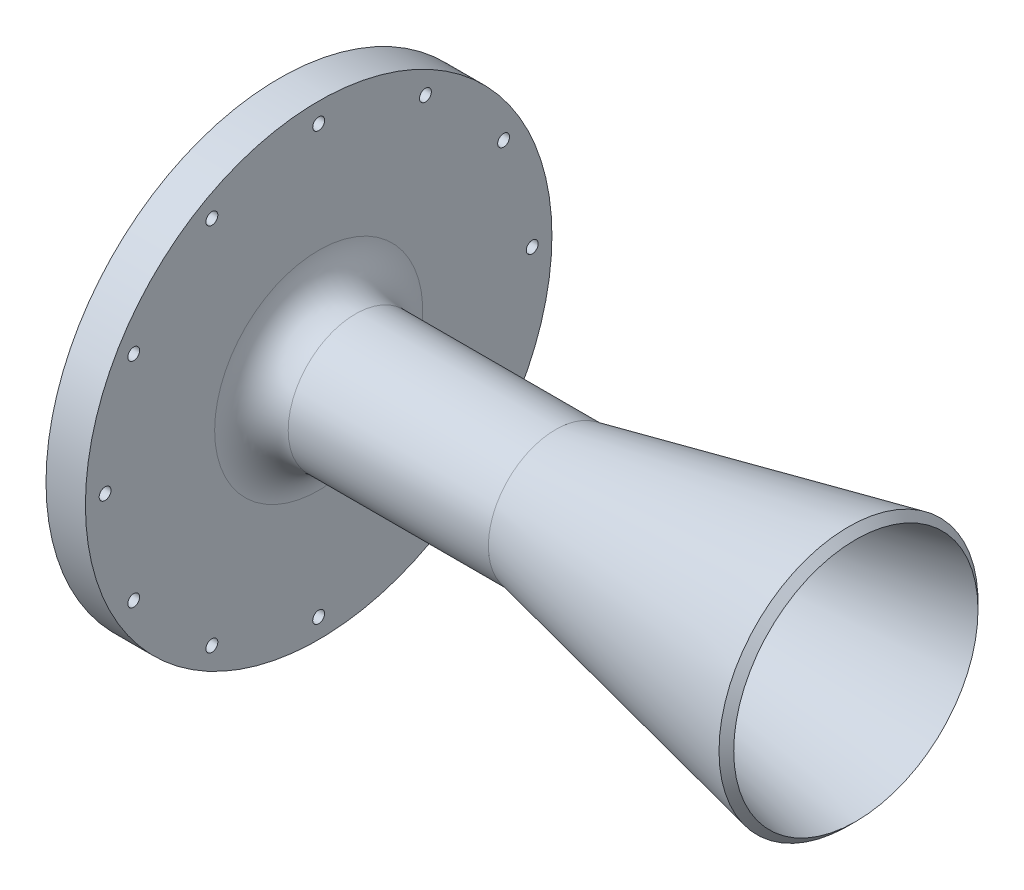
ISO-10303-21;
HEADER;
FILE_DESCRIPTION(('STEP AP214'),'2;1');
FILE_NAME('part.step','',(''),(''),'','','');
FILE_SCHEMA(('AUTOMOTIVE_DESIGN { 1 0 10303 214 1 1 1 1 }'));
ENDSEC;
DATA;
#1=APPLICATION_CONTEXT('core data for automotive mechanical design processes');
#2=APPLICATION_PROTOCOL_DEFINITION('international standard','automotive_design',2000,#1);
#3=PRODUCT_CONTEXT('',#1,'mechanical');
#4=PRODUCT('Part','Part','',(#3));
#5=PRODUCT_RELATED_PRODUCT_CATEGORY('part','',(#4));
#6=PRODUCT_DEFINITION_FORMATION('','',#4);
#7=PRODUCT_DEFINITION_CONTEXT('part definition',#1,'design');
#8=PRODUCT_DEFINITION('design','',#6,#7);
#9=PRODUCT_DEFINITION_SHAPE('','',#8);
#10=(LENGTH_UNIT() NAMED_UNIT(*) SI_UNIT(.MILLI.,.METRE.));
#11=(NAMED_UNIT(*) PLANE_ANGLE_UNIT() SI_UNIT($,.RADIAN.));
#12=(NAMED_UNIT(*) SI_UNIT($,.STERADIAN.) SOLID_ANGLE_UNIT());
#13=UNCERTAINTY_MEASURE_WITH_UNIT(LENGTH_MEASURE(1.E-05),#10,'distance_accuracy_value','');
#14=(GEOMETRIC_REPRESENTATION_CONTEXT(3) GLOBAL_UNCERTAINTY_ASSIGNED_CONTEXT((#13)) GLOBAL_UNIT_ASSIGNED_CONTEXT((#10,
#11,#12)) REPRESENTATION_CONTEXT('',''));
#15=CARTESIAN_POINT('',(0.,0.,0.));
#16=DIRECTION('',(0.,0.,1.));
#17=DIRECTION('',(1.,0.,0.));
#18=AXIS2_PLACEMENT_3D('',#15,#16,#17);
#19=CARTESIAN_POINT('',(0.,20.583496155902,0.));
#20=DIRECTION('',(1.,0.,0.));
#21=DIRECTION('',(0.,0.,-1.));
#22=AXIS2_PLACEMENT_3D('',#19,#20,#21);
#23=PLANE('',#22);
#24=CARTESIAN_POINT('',(0.,0.,0.));
#25=DIRECTION('',(1.,0.,0.));
#26=DIRECTION('',(0.,0.,-1.));
#27=AXIS2_PLACEMENT_3D('',#24,#25,#26);
#28=CIRCLE('',#27,38.1);
#29=CARTESIAN_POINT('',(0.,0.,-38.1));
#30=VERTEX_POINT('',#29);
#31=EDGE_CURVE('E170',#30,#30,#28,.T.);
#32=ORIENTED_EDGE('',*,*,#31,.T.);
#33=EDGE_LOOP('',(#32));
#34=FACE_BOUND('',#33,.T.);
#35=CARTESIAN_POINT('',(0.,-13.3616626129386,49.8664037450867));
#36=DIRECTION('',(-1.,0.,0.));
#37=DIRECTION('',(0.,0.,1.));
#38=AXIS2_PLACEMENT_3D('',#35,#36,#37);
#39=CIRCLE('',#38,2.38125);
#40=CARTESIAN_POINT('',(0.,-13.3616626129386,52.2476537450867));
#41=VERTEX_POINT('',#40);
#42=EDGE_CURVE('E61',#41,#41,#39,.T.);
#43=ORIENTED_EDGE('',*,*,#42,.F.);
#44=EDGE_LOOP('',(#43));
#45=FACE_BOUND('',#44,.T.);
#46=CARTESIAN_POINT('',(0.,13.3616626129382,-49.8664037450868));
#47=DIRECTION('',(-1.,0.,0.));
#48=DIRECTION('',(0.,0.,1.));
#49=AXIS2_PLACEMENT_3D('',#46,#47,#48);
#50=CIRCLE('',#49,2.38125);
#51=CARTESIAN_POINT('',(0.,13.3616626129382,-47.4851537450868));
#52=VERTEX_POINT('',#51);
#53=EDGE_CURVE('E60',#52,#52,#50,.T.);
#54=ORIENTED_EDGE('',*,*,#53,.F.);
#55=EDGE_LOOP('',(#54));
#56=FACE_BOUND('',#55,.T.);
#57=CARTESIAN_POINT('',(0.,-44.7089944830735,-25.81275));
#58=DIRECTION('',(-1.,0.,0.));
#59=DIRECTION('',(0.,0.,1.));
#60=AXIS2_PLACEMENT_3D('',#57,#58,#59);
#61=CIRCLE('',#60,1.43509999999999);
#62=CARTESIAN_POINT('',(0.,-44.7089944830735,-24.37765));
#63=VERTEX_POINT('',#62);
#64=EDGE_CURVE('E79',#63,#63,#61,.T.);
#65=ORIENTED_EDGE('',*,*,#64,.F.);
#66=EDGE_LOOP('',(#65));
#67=FACE_BOUND('',#66,.T.);
#68=CARTESIAN_POINT('',(0.,-25.81275,-44.7089944830735));
#69=DIRECTION('',(-1.,0.,0.));
#70=DIRECTION('',(0.,0.,1.));
#71=AXIS2_PLACEMENT_3D('',#68,#69,#70);
#72=CIRCLE('',#71,1.43509999999999);
#73=CARTESIAN_POINT('',(0.,-25.81275,-43.2738944830735));
#74=VERTEX_POINT('',#73);
#75=EDGE_CURVE('E85',#74,#74,#72,.T.);
#76=ORIENTED_EDGE('',*,*,#75,.F.);
#77=EDGE_LOOP('',(#76));
#78=FACE_BOUND('',#77,.T.);
#79=CARTESIAN_POINT('',(0.,0.,-51.6255));
#80=DIRECTION('',(-1.,0.,0.));
#81=DIRECTION('',(0.,0.,1.));
#82=AXIS2_PLACEMENT_3D('',#79,#80,#81);
#83=CIRCLE('',#82,1.43509999999999);
#84=CARTESIAN_POINT('',(0.,0.,-50.1904));
#85=VERTEX_POINT('',#84);
#86=EDGE_CURVE('E91',#85,#85,#83,.T.);
#87=ORIENTED_EDGE('',*,*,#86,.F.);
#88=EDGE_LOOP('',(#87));
#89=FACE_BOUND('',#88,.T.);
#90=CARTESIAN_POINT('',(0.,25.81275,-44.7089944830735));
#91=DIRECTION('',(-1.,0.,0.));
#92=DIRECTION('',(0.,0.,1.));
#93=AXIS2_PLACEMENT_3D('',#90,#91,#92);
#94=CIRCLE('',#93,1.43509999999999);
#95=CARTESIAN_POINT('',(0.,25.81275,-43.2738944830736));
#96=VERTEX_POINT('',#95);
#97=EDGE_CURVE('E97',#96,#96,#94,.T.);
#98=ORIENTED_EDGE('',*,*,#97,.F.);
#99=EDGE_LOOP('',(#98));
#100=FACE_BOUND('',#99,.T.);
#101=CARTESIAN_POINT('',(0.,44.7089944830735,-25.81275));
#102=DIRECTION('',(-1.,0.,0.));
#103=DIRECTION('',(0.,0.,1.));
#104=AXIS2_PLACEMENT_3D('',#101,#102,#103);
#105=CIRCLE('',#104,1.43509999999999);
#106=CARTESIAN_POINT('',(0.,44.7089944830735,-24.37765));
#107=VERTEX_POINT('',#106);
#108=EDGE_CURVE('E103',#107,#107,#105,.T.);
#109=ORIENTED_EDGE('',*,*,#108,.F.);
#110=EDGE_LOOP('',(#109));
#111=FACE_BOUND('',#110,.T.);
#112=CARTESIAN_POINT('',(0.,51.6255,0.));
#113=DIRECTION('',(-1.,0.,0.));
#114=DIRECTION('',(0.,0.,1.));
#115=AXIS2_PLACEMENT_3D('',#112,#113,#114);
#116=CIRCLE('',#115,1.43509999999999);
#117=CARTESIAN_POINT('',(0.,51.6255,1.43509999999999));
#118=VERTEX_POINT('',#117);
#119=EDGE_CURVE('E109',#118,#118,#116,.T.);
#120=ORIENTED_EDGE('',*,*,#119,.F.);
#121=EDGE_LOOP('',(#120));
#122=FACE_BOUND('',#121,.T.);
#123=CARTESIAN_POINT('',(0.,44.7089944830736,25.81275));
#124=DIRECTION('',(-1.,0.,0.));
#125=DIRECTION('',(0.,0.,1.));
#126=AXIS2_PLACEMENT_3D('',#123,#124,#125);
#127=CIRCLE('',#126,1.43509999999999);
#128=CARTESIAN_POINT('',(0.,44.7089944830736,27.24785));
#129=VERTEX_POINT('',#128);
#130=EDGE_CURVE('E115',#129,#129,#127,.T.);
#131=ORIENTED_EDGE('',*,*,#130,.F.);
#132=EDGE_LOOP('',(#131));
#133=FACE_BOUND('',#132,.T.);
#134=CARTESIAN_POINT('',(0.,25.81275,44.7089944830735));
#135=DIRECTION('',(-1.,0.,0.));
#136=DIRECTION('',(0.,0.,1.));
#137=AXIS2_PLACEMENT_3D('',#134,#135,#136);
#138=CIRCLE('',#137,1.43509999999999);
#139=CARTESIAN_POINT('',(0.,25.81275,46.1440944830735));
#140=VERTEX_POINT('',#139);
#141=EDGE_CURVE('E121',#140,#140,#138,.T.);
#142=ORIENTED_EDGE('',*,*,#141,.F.);
#143=EDGE_LOOP('',(#142));
#144=FACE_BOUND('',#143,.T.);
#145=CARTESIAN_POINT('',(0.,0.,51.6255));
#146=DIRECTION('',(-1.,0.,0.));
#147=DIRECTION('',(0.,0.,1.));
#148=AXIS2_PLACEMENT_3D('',#145,#146,#147);
#149=CIRCLE('',#148,1.43509999999999);
#150=CARTESIAN_POINT('',(0.,0.,53.0606));
#151=VERTEX_POINT('',#150);
#152=EDGE_CURVE('E127',#151,#151,#149,.T.);
#153=ORIENTED_EDGE('',*,*,#152,.F.);
#154=EDGE_LOOP('',(#153));
#155=FACE_BOUND('',#154,.T.);
#156=CARTESIAN_POINT('',(0.,-25.81275,44.7089944830736));
#157=DIRECTION('',(-1.,0.,0.));
#158=DIRECTION('',(0.,0.,1.));
#159=AXIS2_PLACEMENT_3D('',#156,#157,#158);
#160=CIRCLE('',#159,1.43509999999999);
#161=CARTESIAN_POINT('',(0.,-25.81275,46.1440944830736));
#162=VERTEX_POINT('',#161);
#163=EDGE_CURVE('E133',#162,#162,#160,.T.);
#164=ORIENTED_EDGE('',*,*,#163,.F.);
#165=EDGE_LOOP('',(#164));
#166=FACE_BOUND('',#165,.T.);
#167=CARTESIAN_POINT('',(0.,-44.7089944830735,25.81275));
#168=DIRECTION('',(-1.,0.,0.));
#169=DIRECTION('',(0.,0.,1.));
#170=AXIS2_PLACEMENT_3D('',#167,#168,#169);
#171=CIRCLE('',#170,1.43509999999999);
#172=CARTESIAN_POINT('',(0.,-44.7089944830735,27.24785));
#173=VERTEX_POINT('',#172);
#174=EDGE_CURVE('E139',#173,#173,#171,.T.);
#175=ORIENTED_EDGE('',*,*,#174,.F.);
#176=EDGE_LOOP('',(#175));
#177=FACE_BOUND('',#176,.T.);
#178=CARTESIAN_POINT('',(0.,0.,0.));
#179=DIRECTION('',(-1.,0.,0.));
#180=DIRECTION('',(0.,0.,1.));
#181=AXIS2_PLACEMENT_3D('',#178,#179,#180);
#182=CIRCLE('',#181,56.388);
#183=CARTESIAN_POINT('',(0.,0.,56.388));
#184=VERTEX_POINT('',#183);
#185=EDGE_CURVE('E151',#184,#184,#182,.T.);
#186=ORIENTED_EDGE('',*,*,#185,.T.);
#187=EDGE_LOOP('',(#186));
#188=FACE_BOUND('',#187,.T.);
#189=CARTESIAN_POINT('',(0.,-51.6255,0.));
#190=DIRECTION('',(-1.,0.,0.));
#191=DIRECTION('',(0.,0.,1.));
#192=AXIS2_PLACEMENT_3D('',#189,#190,#191);
#193=CIRCLE('',#192,1.43509999999999);
#194=CARTESIAN_POINT('',(0.,-51.6255,1.43509999999999));
#195=VERTEX_POINT('',#194);
#196=EDGE_CURVE('E73',#195,#195,#193,.T.);
#197=ORIENTED_EDGE('',*,*,#196,.F.);
#198=EDGE_LOOP('',(#197));
#199=FACE_BOUND('',#198,.T.);
#200=ADVANCED_FACE('F36',(#34,#45,#56,#67,#78,#89,#100,#111,#122,#133,#144,#155,#166,#177,#188,
#199),#23,.F.);
#201=CARTESIAN_POINT('',(60.325,0.,0.));
#202=DIRECTION('',(1.,0.,0.));
#203=DIRECTION('',(0.,0.,-1.));
#204=AXIS2_PLACEMENT_3D('',#201,#202,#203);
#205=CONICAL_SURFACE('',#204,12.7207818181818,0.20943951023932);
#206=CARTESIAN_POINT('',(139.384584692517,0.,0.));
#207=DIRECTION('',(1.,0.,0.));
#208=DIRECTION('',(0.,0.,-1.));
#209=AXIS2_PLACEMENT_3D('',#206,#207,#208);
#210=CIRCLE('',#209,29.5254153074831);
#211=CARTESIAN_POINT('',(139.384584692517,0.,-29.5254153074831));
#212=VERTEX_POINT('',#211);
#213=EDGE_CURVE('E11',#212,#212,#210,.T.);
#214=ORIENTED_EDGE('',*,*,#213,.T.);
#215=EDGE_LOOP('',(#214));
#216=FACE_BOUND('',#215,.T.);
#217=CARTESIAN_POINT('',(60.325,0.,0.));
#218=DIRECTION('',(-1.,0.,0.));
#219=DIRECTION('',(0.,0.,1.));
#220=AXIS2_PLACEMENT_3D('',#217,#218,#219);
#221=CIRCLE('',#220,12.7207818181818);
#222=CARTESIAN_POINT('',(60.325,0.,12.7207818181818));
#223=VERTEX_POINT('',#222);
#224=EDGE_CURVE('E160',#223,#223,#221,.T.);
#225=ORIENTED_EDGE('',*,*,#224,.T.);
#226=EDGE_LOOP('',(#225));
#227=FACE_BOUND('',#226,.T.);
#228=ADVANCED_FACE('F188',(#216,#227),#205,.F.);
#229=CARTESIAN_POINT('',(60.325,12.7207818181818,0.));
#230=DIRECTION('',(1.,0.,0.));
#231=DIRECTION('',(0.,0.,-1.));
#232=AXIS2_PLACEMENT_3D('',#229,#230,#231);
#233=PLANE('',#232);
#234=ORIENTED_EDGE('',*,*,#224,.F.);
#235=EDGE_LOOP('',(#234));
#236=FACE_BOUND('',#235,.T.);
#237=CARTESIAN_POINT('',(60.325,0.,0.));
#238=DIRECTION('',(-1.,0.,0.));
#239=DIRECTION('',(0.,0.,1.));
#240=AXIS2_PLACEMENT_3D('',#237,#238,#239);
#241=CIRCLE('',#240,14.351);
#242=CARTESIAN_POINT('',(60.325,0.,14.351));
#243=VERTEX_POINT('',#242);
#244=EDGE_CURVE('E157',#243,#243,#241,.T.);
#245=ORIENTED_EDGE('',*,*,#244,.T.);
#246=EDGE_LOOP('',(#245));
#247=FACE_BOUND('',#246,.T.);
#248=ADVANCED_FACE('F194',(#236,#247),#233,.F.);
#249=CARTESIAN_POINT('',(0.,0.,0.));
#250=DIRECTION('',(-1.,0.,0.));
#251=DIRECTION('',(0.,0.,1.));
#252=AXIS2_PLACEMENT_3D('',#249,#250,#251);
#253=CYLINDRICAL_SURFACE('',#252,14.351);
#254=ORIENTED_EDGE('',*,*,#244,.F.);
#255=EDGE_LOOP('',(#254));
#256=FACE_BOUND('',#255,.T.);
#257=CARTESIAN_POINT('',(10.795,0.,0.));
#258=DIRECTION('',(-1.,0.,0.));
#259=DIRECTION('',(0.,0.,1.));
#260=AXIS2_PLACEMENT_3D('',#257,#258,#259);
#261=CIRCLE('',#260,14.351);
#262=CARTESIAN_POINT('',(10.795,0.,14.351));
#263=VERTEX_POINT('',#262);
#264=EDGE_CURVE('E154',#263,#263,#261,.T.);
#265=ORIENTED_EDGE('',*,*,#264,.T.);
#266=EDGE_LOOP('',(#265));
#267=FACE_BOUND('',#266,.T.);
#268=ADVANCED_FACE('F206',(#256,#267),#253,.F.);
#269=CARTESIAN_POINT('',(0.,0.,0.));
#270=DIRECTION('',(-1.,0.,0.));
#271=DIRECTION('',(0.,0.,1.));
#272=AXIS2_PLACEMENT_3D('',#269,#270,#271);
#273=CONICAL_SURFACE('',#272,20.583496155902,0.5235987755983);
#274=CARTESIAN_POINT('',(1.61402236879913,0.,0.));
#275=DIRECTION('',(-1.,0.,0.));
#276=DIRECTION('',(0.,0.,1.));
#277=AXIS2_PLACEMENT_3D('',#274,#275,#276);
#278=CIRCLE('',#277,19.6516399067978);
#279=CARTESIAN_POINT('',(1.61402236879913,0.,19.6516399067978));
#280=VERTEX_POINT('',#279);
#281=EDGE_CURVE('E67',#280,#280,#278,.T.);
#282=ORIENTED_EDGE('',*,*,#281,.T.);
#283=EDGE_LOOP('',(#282));
#284=FACE_BOUND('',#283,.T.);
#285=ORIENTED_EDGE('',*,*,#264,.F.);
#286=EDGE_LOOP('',(#285));
#287=FACE_BOUND('',#286,.T.);
#288=ADVANCED_FACE('F203',(#284,#287),#273,.F.);
#289=CARTESIAN_POINT('',(0.,0.,0.));
#290=DIRECTION('',(-1.,0.,0.));
#291=DIRECTION('',(0.,0.,1.));
#292=AXIS2_PLACEMENT_3D('',#289,#290,#291);
#293=CYLINDRICAL_SURFACE('',#292,56.388);
#294=ORIENTED_EDGE('',*,*,#185,.F.);
#295=EDGE_LOOP('',(#294));
#296=FACE_BOUND('',#295,.T.);
#297=CARTESIAN_POINT('',(9.525,0.,0.));
#298=DIRECTION('',(-1.,0.,0.));
#299=DIRECTION('',(0.,0.,1.));
#300=AXIS2_PLACEMENT_3D('',#297,#298,#299);
#301=CIRCLE('',#300,56.388);
#302=CARTESIAN_POINT('',(9.525,0.,56.388));
#303=VERTEX_POINT('',#302);
#304=EDGE_CURVE('E148',#303,#303,#301,.T.);
#305=ORIENTED_EDGE('',*,*,#304,.T.);
#306=EDGE_LOOP('',(#305));
#307=FACE_BOUND('',#306,.T.);
#308=ADVANCED_FACE('F201',(#296,#307),#293,.T.);
#309=CARTESIAN_POINT('',(9.525,56.388,0.));
#310=DIRECTION('',(-1.,0.,0.));
#311=DIRECTION('',(0.,0.,1.));
#312=AXIS2_PLACEMENT_3D('',#309,#310,#311);
#313=PLANE('',#312);
#314=CARTESIAN_POINT('',(9.525,0.,0.));
#315=DIRECTION('',(-1.,0.,0.));
#316=DIRECTION('',(0.,0.,1.));
#317=AXIS2_PLACEMENT_3D('',#314,#315,#316);
#318=CIRCLE('',#317,25.146);
#319=CARTESIAN_POINT('',(9.525,0.,25.146));
#320=VERTEX_POINT('',#319);
#321=EDGE_CURVE('E163',#320,#320,#318,.T.);
#322=ORIENTED_EDGE('',*,*,#321,.T.);
#323=EDGE_LOOP('',(#322));
#324=FACE_BOUND('',#323,.T.);
#325=CARTESIAN_POINT('',(9.525,-51.6255,0.));
#326=DIRECTION('',(-1.,0.,0.));
#327=DIRECTION('',(0.,0.,1.));
#328=AXIS2_PLACEMENT_3D('',#325,#326,#327);
#329=CIRCLE('',#328,1.43509999999999);
#330=CARTESIAN_POINT('',(9.525,-51.6255,1.43509999999999));
#331=VERTEX_POINT('',#330);
#332=EDGE_CURVE('E76',#331,#331,#329,.T.);
#333=ORIENTED_EDGE('',*,*,#332,.T.);
#334=EDGE_LOOP('',(#333));
#335=FACE_BOUND('',#334,.T.);
#336=CARTESIAN_POINT('',(9.525,-44.7089944830735,-25.81275));
#337=DIRECTION('',(-1.,0.,0.));
#338=DIRECTION('',(0.,0.,1.));
#339=AXIS2_PLACEMENT_3D('',#336,#337,#338);
#340=CIRCLE('',#339,1.43509999999999);
#341=CARTESIAN_POINT('',(9.525,-44.7089944830735,-24.37765));
#342=VERTEX_POINT('',#341);
#343=EDGE_CURVE('E82',#342,#342,#340,.T.);
#344=ORIENTED_EDGE('',*,*,#343,.T.);
#345=EDGE_LOOP('',(#344));
#346=FACE_BOUND('',#345,.T.);
#347=CARTESIAN_POINT('',(9.525,-25.81275,-44.7089944830735));
#348=DIRECTION('',(-1.,0.,0.));
#349=DIRECTION('',(0.,0.,1.));
#350=AXIS2_PLACEMENT_3D('',#347,#348,#349);
#351=CIRCLE('',#350,1.43509999999999);
#352=CARTESIAN_POINT('',(9.525,-25.81275,-43.2738944830735));
#353=VERTEX_POINT('',#352);
#354=EDGE_CURVE('E88',#353,#353,#351,.T.);
#355=ORIENTED_EDGE('',*,*,#354,.T.);
#356=EDGE_LOOP('',(#355));
#357=FACE_BOUND('',#356,.T.);
#358=CARTESIAN_POINT('',(9.525,0.,-51.6255));
#359=DIRECTION('',(-1.,0.,0.));
#360=DIRECTION('',(0.,0.,1.));
#361=AXIS2_PLACEMENT_3D('',#358,#359,#360);
#362=CIRCLE('',#361,1.43509999999999);
#363=CARTESIAN_POINT('',(9.525,0.,-50.1904));
#364=VERTEX_POINT('',#363);
#365=EDGE_CURVE('E94',#364,#364,#362,.T.);
#366=ORIENTED_EDGE('',*,*,#365,.T.);
#367=EDGE_LOOP('',(#366));
#368=FACE_BOUND('',#367,.T.);
#369=CARTESIAN_POINT('',(9.525,25.81275,-44.7089944830735));
#370=DIRECTION('',(-1.,0.,0.));
#371=DIRECTION('',(0.,0.,1.));
#372=AXIS2_PLACEMENT_3D('',#369,#370,#371);
#373=CIRCLE('',#372,1.43509999999999);
#374=CARTESIAN_POINT('',(9.525,25.81275,-43.2738944830736));
#375=VERTEX_POINT('',#374);
#376=EDGE_CURVE('E100',#375,#375,#373,.T.);
#377=ORIENTED_EDGE('',*,*,#376,.T.);
#378=EDGE_LOOP('',(#377));
#379=FACE_BOUND('',#378,.T.);
#380=CARTESIAN_POINT('',(9.525,44.7089944830735,-25.81275));
#381=DIRECTION('',(-1.,0.,0.));
#382=DIRECTION('',(0.,0.,1.));
#383=AXIS2_PLACEMENT_3D('',#380,#381,#382);
#384=CIRCLE('',#383,1.43509999999999);
#385=CARTESIAN_POINT('',(9.525,44.7089944830735,-24.37765));
#386=VERTEX_POINT('',#385);
#387=EDGE_CURVE('E106',#386,#386,#384,.T.);
#388=ORIENTED_EDGE('',*,*,#387,.T.);
#389=EDGE_LOOP('',(#388));
#390=FACE_BOUND('',#389,.T.);
#391=CARTESIAN_POINT('',(9.525,51.6255,0.));
#392=DIRECTION('',(-1.,0.,0.));
#393=DIRECTION('',(0.,0.,1.));
#394=AXIS2_PLACEMENT_3D('',#391,#392,#393);
#395=CIRCLE('',#394,1.43509999999999);
#396=CARTESIAN_POINT('',(9.525,51.6255,1.43509999999999));
#397=VERTEX_POINT('',#396);
#398=EDGE_CURVE('E112',#397,#397,#395,.T.);
#399=ORIENTED_EDGE('',*,*,#398,.T.);
#400=EDGE_LOOP('',(#399));
#401=FACE_BOUND('',#400,.T.);
#402=CARTESIAN_POINT('',(9.525,44.7089944830736,25.81275));
#403=DIRECTION('',(-1.,0.,0.));
#404=DIRECTION('',(0.,0.,1.));
#405=AXIS2_PLACEMENT_3D('',#402,#403,#404);
#406=CIRCLE('',#405,1.43509999999999);
#407=CARTESIAN_POINT('',(9.525,44.7089944830736,27.24785));
#408=VERTEX_POINT('',#407);
#409=EDGE_CURVE('E118',#408,#408,#406,.T.);
#410=ORIENTED_EDGE('',*,*,#409,.T.);
#411=EDGE_LOOP('',(#410));
#412=FACE_BOUND('',#411,.T.);
#413=CARTESIAN_POINT('',(9.525,25.81275,44.7089944830735));
#414=DIRECTION('',(-1.,0.,0.));
#415=DIRECTION('',(0.,0.,1.));
#416=AXIS2_PLACEMENT_3D('',#413,#414,#415);
#417=CIRCLE('',#416,1.43509999999999);
#418=CARTESIAN_POINT('',(9.525,25.81275,46.1440944830735));
#419=VERTEX_POINT('',#418);
#420=EDGE_CURVE('E124',#419,#419,#417,.T.);
#421=ORIENTED_EDGE('',*,*,#420,.T.);
#422=EDGE_LOOP('',(#421));
#423=FACE_BOUND('',#422,.T.);
#424=CARTESIAN_POINT('',(9.525,0.,51.6255));
#425=DIRECTION('',(-1.,0.,0.));
#426=DIRECTION('',(0.,0.,1.));
#427=AXIS2_PLACEMENT_3D('',#424,#425,#426);
#428=CIRCLE('',#427,1.43509999999999);
#429=CARTESIAN_POINT('',(9.525,0.,53.0606));
#430=VERTEX_POINT('',#429);
#431=EDGE_CURVE('E130',#430,#430,#428,.T.);
#432=ORIENTED_EDGE('',*,*,#431,.T.);
#433=EDGE_LOOP('',(#432));
#434=FACE_BOUND('',#433,.T.);
#435=CARTESIAN_POINT('',(9.525,-25.81275,44.7089944830736));
#436=DIRECTION('',(-1.,0.,0.));
#437=DIRECTION('',(0.,0.,1.));
#438=AXIS2_PLACEMENT_3D('',#435,#436,#437);
#439=CIRCLE('',#438,1.43509999999999);
#440=CARTESIAN_POINT('',(9.525,-25.81275,46.1440944830736));
#441=VERTEX_POINT('',#440);
#442=EDGE_CURVE('E136',#441,#441,#439,.T.);
#443=ORIENTED_EDGE('',*,*,#442,.T.);
#444=EDGE_LOOP('',(#443));
#445=FACE_BOUND('',#444,.T.);
#446=CARTESIAN_POINT('',(9.525,-44.7089944830735,25.81275));
#447=DIRECTION('',(-1.,0.,0.));
#448=DIRECTION('',(0.,0.,1.));
#449=AXIS2_PLACEMENT_3D('',#446,#447,#448);
#450=CIRCLE('',#449,1.43509999999999);
#451=CARTESIAN_POINT('',(9.525,-44.7089944830735,27.24785));
#452=VERTEX_POINT('',#451);
#453=EDGE_CURVE('E142',#452,#452,#450,.T.);
#454=ORIENTED_EDGE('',*,*,#453,.T.);
#455=EDGE_LOOP('',(#454));
#456=FACE_BOUND('',#455,.T.);
#457=ORIENTED_EDGE('',*,*,#304,.F.);
#458=EDGE_LOOP('',(#457));
#459=FACE_BOUND('',#458,.T.);
#460=ADVANCED_FACE('F223',(#324,#335,#346,#357,#368,#379,#390,#401,#412,#423,#434,#445,#456,
#459),#313,.F.);
#461=CARTESIAN_POINT('',(0.,0.,0.));
#462=DIRECTION('',(-1.,0.,0.));
#463=DIRECTION('',(0.,0.,1.));
#464=AXIS2_PLACEMENT_3D('',#461,#462,#463);
#465=CYLINDRICAL_SURFACE('',#464,16.256);
#466=CARTESIAN_POINT('',(18.415,0.,0.));
#467=DIRECTION('',(-1.,0.,0.));
#468=DIRECTION('',(0.,0.,1.));
#469=AXIS2_PLACEMENT_3D('',#466,#467,#468);
#470=CIRCLE('',#469,16.256);
#471=CARTESIAN_POINT('',(18.415,0.,16.256));
#472=VERTEX_POINT('',#471);
#473=EDGE_CURVE('E166',#472,#472,#470,.F.);
#474=ORIENTED_EDGE('',*,*,#473,.T.);
#475=EDGE_LOOP('',(#474));
#476=FACE_BOUND('',#475,.T.);
#477=CARTESIAN_POINT('',(66.806461083741,0.,0.));
#478=DIRECTION('',(-1.,0.,0.));
#479=DIRECTION('',(0.,0.,1.));
#480=AXIS2_PLACEMENT_3D('',#477,#478,#479);
#481=CIRCLE('',#480,16.256);
#482=CARTESIAN_POINT('',(66.806461083741,0.,16.256));
#483=VERTEX_POINT('',#482);
#484=EDGE_CURVE('E145',#483,#483,#481,.T.);
#485=ORIENTED_EDGE('',*,*,#484,.T.);
#486=EDGE_LOOP('',(#485));
#487=FACE_BOUND('',#486,.T.);
#488=ADVANCED_FACE('F226',(#476,#487),#465,.T.);
#489=CARTESIAN_POINT('',(139.7,0.,0.));
#490=DIRECTION('',(1.,0.,0.));
#491=DIRECTION('',(0.,0.,-1.));
#492=AXIS2_PLACEMENT_3D('',#489,#490,#491);
#493=CONICAL_SURFACE('',#492,31.75,0.20943951023932);
#494=CARTESIAN_POINT('',(137.605252356639,0.,0.));
#495=DIRECTION('',(-1.,0.,0.));
#496=DIRECTION('',(0.,0.,1.));
#497=AXIS2_PLACEMENT_3D('',#494,#495,#496);
#498=CIRCLE('',#497,31.3047476433608);
#499=CARTESIAN_POINT('',(137.605252356639,0.,31.3047476433608));
#500=VERTEX_POINT('',#499);
#501=EDGE_CURVE('E44',#500,#500,#498,.T.);
#502=ORIENTED_EDGE('',*,*,#501,.T.);
#503=EDGE_LOOP('',(#502));
#504=FACE_BOUND('',#503,.T.);
#505=ORIENTED_EDGE('',*,*,#484,.F.);
#506=EDGE_LOOP('',(#505));
#507=FACE_BOUND('',#506,.T.);
#508=ADVANCED_FACE('F174',(#504,#507),#493,.T.);
#509=CARTESIAN_POINT('',(0.,-44.7089944830735,25.81275));
#510=DIRECTION('',(-1.,0.,0.));
#511=DIRECTION('',(0.,0.,1.));
#512=AXIS2_PLACEMENT_3D('',#509,#510,#511);
#513=CYLINDRICAL_SURFACE('',#512,1.43509999999999);
#514=ORIENTED_EDGE('',*,*,#453,.F.);
#515=EDGE_LOOP('',(#514));
#516=FACE_BOUND('',#515,.T.);
#517=ORIENTED_EDGE('',*,*,#174,.T.);
#518=EDGE_LOOP('',(#517));
#519=FACE_BOUND('',#518,.T.);
#520=ADVANCED_FACE('F312',(#516,#519),#513,.F.);
#521=CARTESIAN_POINT('',(0.,-25.81275,44.7089944830736));
#522=DIRECTION('',(-1.,0.,0.));
#523=DIRECTION('',(0.,0.,1.));
#524=AXIS2_PLACEMENT_3D('',#521,#522,#523);
#525=CYLINDRICAL_SURFACE('',#524,1.43509999999999);
#526=ORIENTED_EDGE('',*,*,#442,.F.);
#527=EDGE_LOOP('',(#526));
#528=FACE_BOUND('',#527,.T.);
#529=ORIENTED_EDGE('',*,*,#163,.T.);
#530=EDGE_LOOP('',(#529));
#531=FACE_BOUND('',#530,.T.);
#532=ADVANCED_FACE('F308',(#528,#531),#525,.F.);
#533=CARTESIAN_POINT('',(0.,0.,51.6255));
#534=DIRECTION('',(-1.,0.,0.));
#535=DIRECTION('',(0.,0.,1.));
#536=AXIS2_PLACEMENT_3D('',#533,#534,#535);
#537=CYLINDRICAL_SURFACE('',#536,1.43509999999999);
#538=ORIENTED_EDGE('',*,*,#431,.F.);
#539=EDGE_LOOP('',(#538));
#540=FACE_BOUND('',#539,.T.);
#541=ORIENTED_EDGE('',*,*,#152,.T.);
#542=EDGE_LOOP('',(#541));
#543=FACE_BOUND('',#542,.T.);
#544=ADVANCED_FACE('F304',(#540,#543),#537,.F.);
#545=CARTESIAN_POINT('',(0.,25.81275,44.7089944830735));
#546=DIRECTION('',(-1.,0.,0.));
#547=DIRECTION('',(0.,0.,1.));
#548=AXIS2_PLACEMENT_3D('',#545,#546,#547);
#549=CYLINDRICAL_SURFACE('',#548,1.43509999999999);
#550=ORIENTED_EDGE('',*,*,#420,.F.);
#551=EDGE_LOOP('',(#550));
#552=FACE_BOUND('',#551,.T.);
#553=ORIENTED_EDGE('',*,*,#141,.T.);
#554=EDGE_LOOP('',(#553));
#555=FACE_BOUND('',#554,.T.);
#556=ADVANCED_FACE('F300',(#552,#555),#549,.F.);
#557=CARTESIAN_POINT('',(0.,44.7089944830736,25.81275));
#558=DIRECTION('',(-1.,0.,0.));
#559=DIRECTION('',(0.,0.,1.));
#560=AXIS2_PLACEMENT_3D('',#557,#558,#559);
#561=CYLINDRICAL_SURFACE('',#560,1.43509999999999);
#562=ORIENTED_EDGE('',*,*,#409,.F.);
#563=EDGE_LOOP('',(#562));
#564=FACE_BOUND('',#563,.T.);
#565=ORIENTED_EDGE('',*,*,#130,.T.);
#566=EDGE_LOOP('',(#565));
#567=FACE_BOUND('',#566,.T.);
#568=ADVANCED_FACE('F296',(#564,#567),#561,.F.);
#569=CARTESIAN_POINT('',(0.,51.6255,0.));
#570=DIRECTION('',(-1.,0.,0.));
#571=DIRECTION('',(0.,0.,1.));
#572=AXIS2_PLACEMENT_3D('',#569,#570,#571);
#573=CYLINDRICAL_SURFACE('',#572,1.43509999999999);
#574=ORIENTED_EDGE('',*,*,#398,.F.);
#575=EDGE_LOOP('',(#574));
#576=FACE_BOUND('',#575,.T.);
#577=ORIENTED_EDGE('',*,*,#119,.T.);
#578=EDGE_LOOP('',(#577));
#579=FACE_BOUND('',#578,.T.);
#580=ADVANCED_FACE('F292',(#576,#579),#573,.F.);
#581=CARTESIAN_POINT('',(0.,44.7089944830735,-25.81275));
#582=DIRECTION('',(-1.,0.,0.));
#583=DIRECTION('',(0.,0.,1.));
#584=AXIS2_PLACEMENT_3D('',#581,#582,#583);
#585=CYLINDRICAL_SURFACE('',#584,1.43509999999999);
#586=ORIENTED_EDGE('',*,*,#387,.F.);
#587=EDGE_LOOP('',(#586));
#588=FACE_BOUND('',#587,.T.);
#589=ORIENTED_EDGE('',*,*,#108,.T.);
#590=EDGE_LOOP('',(#589));
#591=FACE_BOUND('',#590,.T.);
#592=ADVANCED_FACE('F288',(#588,#591),#585,.F.);
#593=CARTESIAN_POINT('',(0.,25.81275,-44.7089944830735));
#594=DIRECTION('',(-1.,0.,0.));
#595=DIRECTION('',(0.,0.,1.));
#596=AXIS2_PLACEMENT_3D('',#593,#594,#595);
#597=CYLINDRICAL_SURFACE('',#596,1.43509999999999);
#598=ORIENTED_EDGE('',*,*,#376,.F.);
#599=EDGE_LOOP('',(#598));
#600=FACE_BOUND('',#599,.T.);
#601=ORIENTED_EDGE('',*,*,#97,.T.);
#602=EDGE_LOOP('',(#601));
#603=FACE_BOUND('',#602,.T.);
#604=ADVANCED_FACE('F284',(#600,#603),#597,.F.);
#605=CARTESIAN_POINT('',(0.,0.,-51.6255));
#606=DIRECTION('',(-1.,0.,0.));
#607=DIRECTION('',(0.,0.,1.));
#608=AXIS2_PLACEMENT_3D('',#605,#606,#607);
#609=CYLINDRICAL_SURFACE('',#608,1.43509999999999);
#610=ORIENTED_EDGE('',*,*,#365,.F.);
#611=EDGE_LOOP('',(#610));
#612=FACE_BOUND('',#611,.T.);
#613=ORIENTED_EDGE('',*,*,#86,.T.);
#614=EDGE_LOOP('',(#613));
#615=FACE_BOUND('',#614,.T.);
#616=ADVANCED_FACE('F280',(#612,#615),#609,.F.);
#617=CARTESIAN_POINT('',(0.,-25.81275,-44.7089944830735));
#618=DIRECTION('',(-1.,0.,0.));
#619=DIRECTION('',(0.,0.,1.));
#620=AXIS2_PLACEMENT_3D('',#617,#618,#619);
#621=CYLINDRICAL_SURFACE('',#620,1.43509999999999);
#622=ORIENTED_EDGE('',*,*,#354,.F.);
#623=EDGE_LOOP('',(#622));
#624=FACE_BOUND('',#623,.T.);
#625=ORIENTED_EDGE('',*,*,#75,.T.);
#626=EDGE_LOOP('',(#625));
#627=FACE_BOUND('',#626,.T.);
#628=ADVANCED_FACE('F273',(#624,#627),#621,.F.);
#629=CARTESIAN_POINT('',(0.,-44.7089944830735,-25.81275));
#630=DIRECTION('',(-1.,0.,0.));
#631=DIRECTION('',(0.,0.,1.));
#632=AXIS2_PLACEMENT_3D('',#629,#630,#631);
#633=CYLINDRICAL_SURFACE('',#632,1.43509999999999);
#634=ORIENTED_EDGE('',*,*,#343,.F.);
#635=EDGE_LOOP('',(#634));
#636=FACE_BOUND('',#635,.T.);
#637=ORIENTED_EDGE('',*,*,#64,.T.);
#638=EDGE_LOOP('',(#637));
#639=FACE_BOUND('',#638,.T.);
#640=ADVANCED_FACE('F265',(#636,#639),#633,.F.);
#641=CARTESIAN_POINT('',(0.,-51.6255,0.));
#642=DIRECTION('',(-1.,0.,0.));
#643=DIRECTION('',(0.,0.,1.));
#644=AXIS2_PLACEMENT_3D('',#641,#642,#643);
#645=CYLINDRICAL_SURFACE('',#644,1.43509999999999);
#646=ORIENTED_EDGE('',*,*,#332,.F.);
#647=EDGE_LOOP('',(#646));
#648=FACE_BOUND('',#647,.T.);
#649=ORIENTED_EDGE('',*,*,#196,.T.);
#650=EDGE_LOOP('',(#649));
#651=FACE_BOUND('',#650,.T.);
#652=ADVANCED_FACE('F262',(#648,#651),#645,.F.);
#653=CARTESIAN_POINT('',(6.35,13.3616626129382,-49.8664037450868));
#654=DIRECTION('',(-1.,0.,0.));
#655=DIRECTION('',(0.,0.,1.));
#656=AXIS2_PLACEMENT_3D('',#653,#654,#655);
#657=CONICAL_SURFACE('',#656,2.38124999999999,1.02974425867665);
#658=CARTESIAN_POINT('',(7.78079934905938,13.3616626129382,-49.8664037450868));
#659=VERTEX_POINT('',#658);
#660=VERTEX_LOOP('',#659);
#661=FACE_BOUND('',#660,.T.);
#662=CARTESIAN_POINT('',(6.35,13.3616626129382,-49.8664037450868));
#663=DIRECTION('',(-1.,0.,0.));
#664=DIRECTION('',(0.,0.,1.));
#665=AXIS2_PLACEMENT_3D('',#662,#663,#664);
#666=CIRCLE('',#665,2.38124999999999);
#667=CARTESIAN_POINT('',(6.35,13.3616626129382,-47.4851537450868));
#668=VERTEX_POINT('',#667);
#669=EDGE_CURVE('E64',#668,#668,#666,.T.);
#670=ORIENTED_EDGE('',*,*,#669,.T.);
#671=EDGE_LOOP('',(#670));
#672=FACE_BOUND('',#671,.T.);
#673=ADVANCED_FACE('F264',(#661,#672),#657,.F.);
#674=CARTESIAN_POINT('',(0.,13.3616626129382,-49.8664037450868));
#675=DIRECTION('',(-1.,0.,0.));
#676=DIRECTION('',(0.,0.,1.));
#677=AXIS2_PLACEMENT_3D('',#674,#675,#676);
#678=CYLINDRICAL_SURFACE('',#677,2.38125);
#679=ORIENTED_EDGE('',*,*,#669,.F.);
#680=EDGE_LOOP('',(#679));
#681=FACE_BOUND('',#680,.T.);
#682=ORIENTED_EDGE('',*,*,#53,.T.);
#683=EDGE_LOOP('',(#682));
#684=FACE_BOUND('',#683,.T.);
#685=ADVANCED_FACE('F54',(#681,#684),#678,.F.);
#686=CARTESIAN_POINT('',(6.35,-13.3616626129386,49.8664037450867));
#687=DIRECTION('',(-1.,0.,0.));
#688=DIRECTION('',(0.,0.,1.));
#689=AXIS2_PLACEMENT_3D('',#686,#687,#688);
#690=CONICAL_SURFACE('',#689,2.38125,1.02974425867665);
#691=CARTESIAN_POINT('',(7.78079934905938,-13.3616626129386,49.8664037450867));
#692=VERTEX_POINT('',#691);
#693=VERTEX_LOOP('',#692);
#694=FACE_BOUND('',#693,.T.);
#695=CARTESIAN_POINT('',(6.35,-13.3616626129386,49.8664037450867));
#696=DIRECTION('',(-1.,0.,0.));
#697=DIRECTION('',(0.,0.,1.));
#698=AXIS2_PLACEMENT_3D('',#695,#696,#697);
#699=CIRCLE('',#698,2.38125);
#700=CARTESIAN_POINT('',(6.35,-13.3616626129386,52.2476537450867));
#701=VERTEX_POINT('',#700);
#702=EDGE_CURVE('E58',#701,#701,#699,.T.);
#703=ORIENTED_EDGE('',*,*,#702,.T.);
#704=EDGE_LOOP('',(#703));
#705=FACE_BOUND('',#704,.T.);
#706=ADVANCED_FACE('F50',(#694,#705),#690,.F.);
#707=CARTESIAN_POINT('',(0.,-13.3616626129386,49.8664037450867));
#708=DIRECTION('',(-1.,0.,0.));
#709=DIRECTION('',(0.,0.,1.));
#710=AXIS2_PLACEMENT_3D('',#707,#708,#709);
#711=CYLINDRICAL_SURFACE('',#710,2.38125);
#712=ORIENTED_EDGE('',*,*,#702,.F.);
#713=EDGE_LOOP('',(#712));
#714=FACE_BOUND('',#713,.T.);
#715=ORIENTED_EDGE('',*,*,#42,.T.);
#716=EDGE_LOOP('',(#715));
#717=FACE_BOUND('',#716,.T.);
#718=ADVANCED_FACE('F53',(#714,#717),#711,.F.);
#719=CARTESIAN_POINT('',(18.415,0.,0.));
#720=DIRECTION('',(-1.,0.,0.));
#721=DIRECTION('',(0.,0.,1.));
#722=AXIS2_PLACEMENT_3D('',#719,#720,#721);
#723=TOROIDAL_SURFACE('',#722,25.146,8.89);
#724=ORIENTED_EDGE('',*,*,#473,.F.);
#725=EDGE_LOOP('',(#724));
#726=FACE_BOUND('',#725,.T.);
#727=ORIENTED_EDGE('',*,*,#321,.F.);
#728=EDGE_LOOP('',(#727));
#729=FACE_BOUND('',#728,.T.);
#730=ADVANCED_FACE('F183',(#726,#729),#723,.F.);
#731=CARTESIAN_POINT('',(3.33331808033745,0.,0.));
#732=DIRECTION('',(-1.,0.,0.));
#733=DIRECTION('',(0.,0.,1.));
#734=AXIS2_PLACEMENT_3D('',#731,#732,#733);
#735=CONICAL_SURFACE('',#734,0.,1.48352986419519);
#736=ORIENTED_EDGE('',*,*,#31,.F.);
#737=EDGE_LOOP('',(#736));
#738=FACE_BOUND('',#737,.T.);
#739=ORIENTED_EDGE('',*,*,#281,.F.);
#740=EDGE_LOOP('',(#739));
#741=FACE_BOUND('',#740,.T.);
#742=ADVANCED_FACE('F178',(#738,#741),#735,.F.);
#743=CARTESIAN_POINT('',(137.605252356639,0.,0.));
#744=DIRECTION('',(-1.,0.,0.));
#745=DIRECTION('',(0.,0.,1.));
#746=AXIS2_PLACEMENT_3D('',#743,#744,#745);
#747=CONICAL_SURFACE('',#746,31.3047476433608,0.78539816339744);
#748=ORIENTED_EDGE('',*,*,#213,.F.);
#749=EDGE_LOOP('',(#748));
#750=FACE_BOUND('',#749,.T.);
#751=ORIENTED_EDGE('',*,*,#501,.F.);
#752=EDGE_LOOP('',(#751));
#753=FACE_BOUND('',#752,.T.);
#754=ADVANCED_FACE('F38',(#750,#753),#747,.T.);
#755=CLOSED_SHELL('',(#200,#228,#248,#268,#288,#308,#460,#488,#508,#520,#532,#544,#556,#568,
#580,#592,#604,#616,#628,#640,#652,#673,#685,#706,#718,#730,#742,#754));
#756=MANIFOLD_SOLID_BREP('B2',#755);
#757=ADVANCED_BREP_SHAPE_REPRESENTATION('',(#18,#756),#14);
#758=SHAPE_DEFINITION_REPRESENTATION(#9,#757);
ENDSEC;
END-ISO-10303-21;
